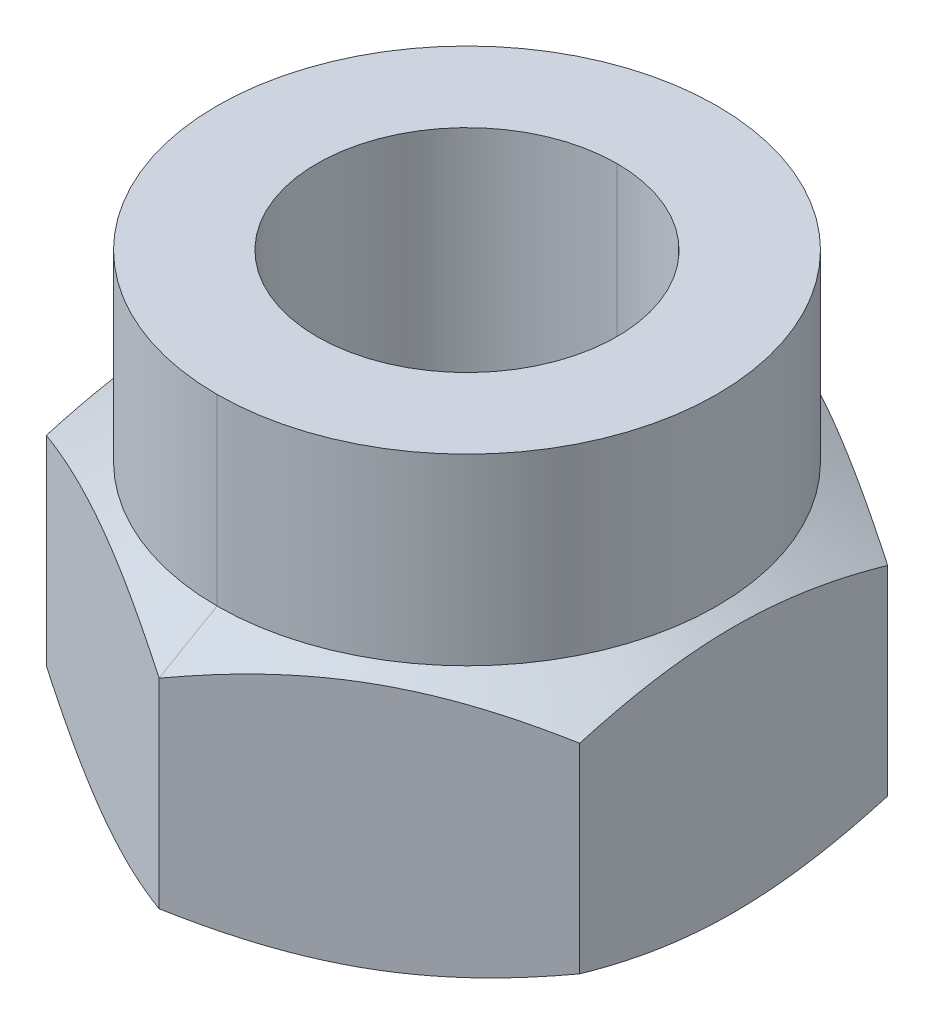
ISO-10303-21;
HEADER;
FILE_DESCRIPTION(('STEP AP214'),'2;1');
FILE_NAME('part.step','',(''),(''),'','','');
FILE_SCHEMA(('AUTOMOTIVE_DESIGN { 1 0 10303 214 1 1 1 1 }'));
ENDSEC;
DATA;
#1=APPLICATION_CONTEXT('core data for automotive mechanical design processes');
#2=APPLICATION_PROTOCOL_DEFINITION('international standard','automotive_design',2000,#1);
#3=PRODUCT_CONTEXT('',#1,'mechanical');
#4=PRODUCT('Part','Part','',(#3));
#5=PRODUCT_RELATED_PRODUCT_CATEGORY('part','',(#4));
#6=PRODUCT_DEFINITION_FORMATION('','',#4);
#7=PRODUCT_DEFINITION_CONTEXT('part definition',#1,'design');
#8=PRODUCT_DEFINITION('design','',#6,#7);
#9=PRODUCT_DEFINITION_SHAPE('','',#8);
#10=(LENGTH_UNIT() NAMED_UNIT(*) SI_UNIT(.MILLI.,.METRE.));
#11=(NAMED_UNIT(*) PLANE_ANGLE_UNIT() SI_UNIT($,.RADIAN.));
#12=(NAMED_UNIT(*) SI_UNIT($,.STERADIAN.) SOLID_ANGLE_UNIT());
#13=UNCERTAINTY_MEASURE_WITH_UNIT(LENGTH_MEASURE(1.E-05),#10,'distance_accuracy_value','');
#14=(GEOMETRIC_REPRESENTATION_CONTEXT(3) GLOBAL_UNCERTAINTY_ASSIGNED_CONTEXT((#13)) GLOBAL_UNIT_ASSIGNED_CONTEXT((#10,
#11,#12)) REPRESENTATION_CONTEXT('',''));
#15=CARTESIAN_POINT('',(0.,0.,0.));
#16=DIRECTION('',(0.,0.,1.));
#17=DIRECTION('',(1.,0.,0.));
#18=AXIS2_PLACEMENT_3D('',#15,#16,#17);
#19=CARTESIAN_POINT('',(86.966,-199.355596428142,0.));
#20=DIRECTION('',(0.,1.,0.));
#21=DIRECTION('',(0.,0.,-1.));
#22=AXIS2_PLACEMENT_3D('',#19,#20,#21);
#23=CONICAL_SURFACE('',#22,14.9987,1.0471975511966);
#24=DIRECTION('',(0.,0.5,0.86602540378444));
#25=VECTOR('',#24,1.);
#26=CARTESIAN_POINT('',(86.966,-199.355596428142,14.9987));
#27=LINE('',#26,#25);
#28=CARTESIAN_POINT('',(86.966,-199.355596428142,14.9987));
#29=VERTEX_POINT('',#28);
#30=CARTESIAN_POINT('',(86.966,-197.347099910636,18.4775180151448));
#31=VERTEX_POINT('',#30);
#32=EDGE_CURVE('E151',#29,#31,#27,.T.);
#33=ORIENTED_EDGE('',*,*,#32,.F.);
#34=CARTESIAN_POINT('',(86.966,-199.355596428142,0.));
#35=DIRECTION('',(0.,1.,0.));
#36=DIRECTION('',(0.,0.,-1.));
#37=AXIS2_PLACEMENT_3D('',#34,#35,#36);
#38=CIRCLE('',#37,14.9987);
#39=CARTESIAN_POINT('',(86.966,-199.355596428142,-14.9987));
#40=VERTEX_POINT('',#39);
#41=EDGE_CURVE('E138',#29,#40,#38,.T.);
#42=ORIENTED_EDGE('',*,*,#41,.T.);
#43=DIRECTION('',(0.,0.5,-0.86602540378444));
#44=VECTOR('',#43,1.);
#45=CARTESIAN_POINT('',(86.966,-199.355596428142,-14.9987));
#46=LINE('',#45,#44);
#47=CARTESIAN_POINT('',(86.966,-197.347099910636,-18.4775180151448));
#48=VERTEX_POINT('',#47);
#49=EDGE_CURVE('E163',#40,#48,#46,.T.);
#50=ORIENTED_EDGE('',*,*,#49,.T.);
#51=CARTESIAN_POINT('',(102.968,-197.347099910636,-9.2387590075724));
#52=CARTESIAN_POINT('',(100.890690690198,-198.039536347237,-10.4380940967768));
#53=CARTESIAN_POINT('',(99.0159936070079,-198.390078069863,-11.5204509624055));
#54=CARTESIAN_POINT('',(96.9583084856887,-198.774835956091,-12.7084560211066));
#55=CARTESIAN_POINT('',(94.9822913717909,-198.776335278788,-13.8493100337388));
#56=CARTESIAN_POINT('',(92.9968654590966,-198.777841740505,-14.995596218889));
#57=CARTESIAN_POINT('',(90.9278801341037,-198.39192205042,-16.190125453223));
#58=CARTESIAN_POINT('',(89.0491954225666,-198.041498384825,-17.2747845771514));
#59=CARTESIAN_POINT('',(86.966,-197.347099910636,-18.4775180151448));
#60=B_SPLINE_CURVE_WITH_KNOTS('',2,(#51,#52,#53,#54,#55,#56,#57,#58,#59),.UNSPECIFIED.,.F.,.F.,
(3,2,2,2,3),(0.,0.25,0.5,0.75,1.),.UNSPECIFIED.);
#61=CARTESIAN_POINT('',(102.968,-197.347099910636,-9.2387590075724));
#62=VERTEX_POINT('',#61);
#63=EDGE_CURVE('E233',#62,#48,#60,.T.);
#64=ORIENTED_EDGE('',*,*,#63,.F.);
#65=CARTESIAN_POINT('',(102.968,-197.347099910636,9.23875900757241));
#66=CARTESIAN_POINT('',(102.968,-198.037173549061,6.84827380214206));
#67=CARTESIAN_POINT('',(102.968,-198.387636491745,4.69043192534636));
#68=CARTESIAN_POINT('',(102.968,-198.776049325974,2.29892806828571));
#69=CARTESIAN_POINT('',(102.968,-198.776340740164,0.00300499255484997));
#70=CARTESIAN_POINT('',(102.968,-198.776630186264,-2.27741237560147));
#71=CARTESIAN_POINT('',(102.968,-198.39364173088,-4.65331801131239));
#72=CARTESIAN_POINT('',(102.968,-198.043170561929,-6.82749954017989));
#73=CARTESIAN_POINT('',(102.968,-197.347099910636,-9.23875900757239));
#74=B_SPLINE_CURVE_WITH_KNOTS('',2,(#65,#66,#67,#68,#69,#70,#71,#72,#73),.UNSPECIFIED.,.F.,.F.,
(3,2,2,2,3),(0.,0.25,0.5,0.75,1.),.UNSPECIFIED.);
#75=CARTESIAN_POINT('',(102.968,-197.347099910636,9.23875900757242));
#76=VERTEX_POINT('',#75);
#77=EDGE_CURVE('E491',#76,#62,#74,.T.);
#78=ORIENTED_EDGE('',*,*,#77,.F.);
#79=CARTESIAN_POINT('',(86.966,-197.347099910636,18.4775180151448));
#80=CARTESIAN_POINT('',(89.0433093086175,-198.039536346842,17.2781829266244));
#81=CARTESIAN_POINT('',(90.9180063929921,-198.390078069863,16.1958260603117));
#82=CARTESIAN_POINT('',(92.9756915139104,-198.774835956207,15.007821001842));
#83=CARTESIAN_POINT('',(94.9517086282091,-198.776335278788,13.8669669889784));
#84=CARTESIAN_POINT('',(96.9371345428436,-198.77784174039,12.7206808027081));
#85=CARTESIAN_POINT('',(99.0061198658963,-198.39192205042,11.5261515694942));
#86=CARTESIAN_POINT('',(100.884804578962,-198.041498384316,10.4414924446834));
#87=CARTESIAN_POINT('',(102.968,-197.347099910636,9.23875900757243));
#88=B_SPLINE_CURVE_WITH_KNOTS('',2,(#79,#80,#81,#82,#83,#84,#85,#86,#87),.UNSPECIFIED.,.F.,.F.,
(3,2,2,2,3),(0.,0.25,0.5,0.75,1.),.UNSPECIFIED.);
#89=EDGE_CURVE('E153',#31,#76,#88,.T.);
#90=ORIENTED_EDGE('',*,*,#89,.F.);
#91=EDGE_LOOP('',(#33,#42,#50,#64,#78,#90));
#92=FACE_BOUND('',#91,.T.);
#93=ADVANCED_FACE('F38',(#92),#23,.T.);
#94=CARTESIAN_POINT('',(86.966,-183.353596428142,0.));
#95=DIRECTION('',(0.,-1.,0.));
#96=DIRECTION('',(0.,0.,1.));
#97=AXIS2_PLACEMENT_3D('',#94,#95,#96);
#98=CONICAL_SURFACE('',#97,14.9987,1.0471975511966);
#99=DIRECTION('',(0.,-0.5,-0.86602540378444));
#100=VECTOR('',#99,1.);
#101=CARTESIAN_POINT('',(86.966,-183.353596428142,-14.9987));
#102=LINE('',#101,#100);
#103=CARTESIAN_POINT('',(86.966,-183.353596428142,-14.9987));
#104=VERTEX_POINT('',#103);
#105=CARTESIAN_POINT('',(86.966,-185.362092945648,-18.4775180151448));
#106=VERTEX_POINT('',#105);
#107=EDGE_CURVE('E183',#104,#106,#102,.T.);
#108=ORIENTED_EDGE('',*,*,#107,.F.);
#109=CARTESIAN_POINT('',(86.966,-183.353596428142,0.));
#110=DIRECTION('',(0.,-1.,0.));
#111=DIRECTION('',(0.,0.,1.));
#112=AXIS2_PLACEMENT_3D('',#109,#110,#111);
#113=CIRCLE('',#112,14.9987);
#114=CARTESIAN_POINT('',(86.966,-183.353596428142,14.9987));
#115=VERTEX_POINT('',#114);
#116=EDGE_CURVE('E178',#104,#115,#113,.T.);
#117=ORIENTED_EDGE('',*,*,#116,.T.);
#118=DIRECTION('',(0.,-0.5,0.86602540378444));
#119=VECTOR('',#118,1.);
#120=CARTESIAN_POINT('',(86.966,-183.353596428142,14.9987));
#121=LINE('',#120,#119);
#122=CARTESIAN_POINT('',(86.966,-185.362092945648,18.4775180151448));
#123=VERTEX_POINT('',#122);
#124=EDGE_CURVE('E193',#115,#123,#121,.T.);
#125=ORIENTED_EDGE('',*,*,#124,.T.);
#126=CARTESIAN_POINT('',(102.968,-185.362092945648,9.23875900757243));
#127=CARTESIAN_POINT('',(100.890690690612,-184.669656509184,10.438094096538));
#128=CARTESIAN_POINT('',(99.0159936070079,-184.319114786421,11.5204509624055));
#129=CARTESIAN_POINT('',(96.9583084844915,-183.934356899902,12.7084560217979));
#130=CARTESIAN_POINT('',(94.9822913717909,-183.932857577496,13.8493100337389));
#131=CARTESIAN_POINT('',(92.9968654566087,-183.931351116068,14.9955962203253));
#132=CARTESIAN_POINT('',(90.9278801341037,-184.317270805864,16.190125453223));
#133=CARTESIAN_POINT('',(89.0491954214829,-184.66769447182,17.2747845777771));
#134=CARTESIAN_POINT('',(86.966,-185.362092945648,18.4775180151448));
#135=B_SPLINE_CURVE_WITH_KNOTS('',2,(#126,#127,#128,#129,#130,#131,#132,#133,#134),
.UNSPECIFIED.,.F.,.F.,(3,2,2,2,3),(0.,0.25,0.5,0.75,1.),.UNSPECIFIED.);
#136=CARTESIAN_POINT('',(102.968,-185.362092945648,9.23875900757242));
#137=VERTEX_POINT('',#136);
#138=EDGE_CURVE('E270',#137,#123,#135,.T.);
#139=ORIENTED_EDGE('',*,*,#138,.F.);
#140=CARTESIAN_POINT('',(102.968,-185.362092945648,-9.23875900757239));
#141=CARTESIAN_POINT('',(102.968,-184.666183307134,-6.82805730480819));
#142=CARTESIAN_POINT('',(102.968,-184.315551343411,-4.65331936360419));
#143=CARTESIAN_POINT('',(102.968,-183.932645227434,-2.27840622250425));
#144=CARTESIAN_POINT('',(102.968,-183.932852118989,0.00303134117684949));
#145=CARTESIAN_POINT('',(102.968,-183.933060235124,2.29797259728489));
#146=CARTESIAN_POINT('',(102.968,-184.321566621199,4.69049508264128));
#147=CARTESIAN_POINT('',(102.968,-184.671871108535,6.8477604268291));
#148=CARTESIAN_POINT('',(102.968,-185.362092945648,9.23875900757241));
#149=B_SPLINE_CURVE_WITH_KNOTS('',2,(#140,#141,#142,#143,#144,#145,#146,#147,#148),
.UNSPECIFIED.,.F.,.F.,(3,2,2,2,3),(0.,0.25,0.5,0.75,1.),.UNSPECIFIED.);
#150=CARTESIAN_POINT('',(102.968,-185.362092945648,-9.2387590075724));
#151=VERTEX_POINT('',#150);
#152=EDGE_CURVE('E475',#151,#137,#149,.T.);
#153=ORIENTED_EDGE('',*,*,#152,.F.);
#154=CARTESIAN_POINT('',(86.966,-185.362092945648,-18.4775180151448));
#155=CARTESIAN_POINT('',(89.0433093097333,-184.669656509069,-17.2781829259802));
#156=CARTESIAN_POINT('',(90.9180063929922,-184.319114786421,-16.1958260603116));
#157=CARTESIAN_POINT('',(92.9756915154957,-183.93435689996,-15.0078210009268));
#158=CARTESIAN_POINT('',(94.9517086282091,-183.932857577496,-13.8669669889784));
#159=CARTESIAN_POINT('',(96.9371345434402,-183.93135111601,-12.7206808023636));
#160=CARTESIAN_POINT('',(99.0061198658963,-184.317270805864,-11.5261515694942));
#161=CARTESIAN_POINT('',(100.884804578934,-184.667694471959,-10.4414924446994));
#162=CARTESIAN_POINT('',(102.968,-185.362092945648,-9.2387590075724));
#163=B_SPLINE_CURVE_WITH_KNOTS('',2,(#154,#155,#156,#157,#158,#159,#160,#161,#162),
.UNSPECIFIED.,.F.,.F.,(3,2,2,2,3),(0.,0.25,0.5,0.75,1.),.UNSPECIFIED.);
#164=EDGE_CURVE('E65',#106,#151,#163,.T.);
#165=ORIENTED_EDGE('',*,*,#164,.F.);
#166=EDGE_LOOP('',(#108,#117,#125,#139,#153,#165));
#167=FACE_BOUND('',#166,.T.);
#168=ADVANCED_FACE('F247',(#167),#98,.T.);
#169=CARTESIAN_POINT('',(86.966,-198.847596428142,0.));
#170=DIRECTION('',(0.,-1.,0.));
#171=DIRECTION('',(0.,0.,-1.));
#172=AXIS2_PLACEMENT_3D('',#169,#170,#171);
#173=CONICAL_SURFACE('',#172,9.,0.785398163397426);
#174=DIRECTION('',(0.,-0.707106781186563,0.707106781186532));
#175=VECTOR('',#174,1.);
#176=CARTESIAN_POINT('',(86.966,-198.847596428142,9.));
#177=LINE('',#176,#175);
#178=CARTESIAN_POINT('',(86.966,-198.847596428142,9.));
#179=VERTEX_POINT('',#178);
#180=CARTESIAN_POINT('',(86.966,-199.355596428142,9.508));
#181=VERTEX_POINT('',#180);
#182=EDGE_CURVE('E192',#179,#181,#177,.T.);
#183=ORIENTED_EDGE('',*,*,#182,.F.);
#184=CARTESIAN_POINT('',(86.966,-198.847596428142,0.));
#185=DIRECTION('',(0.,1.,0.));
#186=DIRECTION('',(0.,0.,-1.));
#187=AXIS2_PLACEMENT_3D('',#184,#185,#186);
#188=CIRCLE('',#187,9.);
#189=CARTESIAN_POINT('',(86.966,-198.847596428142,-9.));
#190=VERTEX_POINT('',#189);
#191=EDGE_CURVE('E11',#179,#190,#188,.T.);
#192=ORIENTED_EDGE('',*,*,#191,.T.);
#193=DIRECTION('',(0.,-0.707106781186563,-0.707106781186532));
#194=VECTOR('',#193,1.);
#195=CARTESIAN_POINT('',(86.966,-198.847596428142,-9.));
#196=LINE('',#195,#194);
#197=CARTESIAN_POINT('',(86.966,-199.355596428142,-9.508));
#198=VERTEX_POINT('',#197);
#199=EDGE_CURVE('E495',#190,#198,#196,.T.);
#200=ORIENTED_EDGE('',*,*,#199,.T.);
#201=CARTESIAN_POINT('',(86.966,-199.355596428142,0.));
#202=DIRECTION('',(0.,-1.,0.));
#203=DIRECTION('',(0.,0.,-1.));
#204=AXIS2_PLACEMENT_3D('',#201,#202,#203);
#205=CIRCLE('',#204,9.508);
#206=EDGE_CURVE('E147',#198,#181,#205,.T.);
#207=ORIENTED_EDGE('',*,*,#206,.T.);
#208=EDGE_LOOP('',(#183,#192,#200,#207));
#209=FACE_BOUND('',#208,.T.);
#210=ADVANCED_FACE('F40',(#209),#173,.F.);
#211=CARTESIAN_POINT('',(86.966,-183.353596428142,0.));
#212=DIRECTION('',(0.,1.,0.));
#213=DIRECTION('',(0.,0.,1.));
#214=AXIS2_PLACEMENT_3D('',#211,#212,#213);
#215=CYLINDRICAL_SURFACE('',#214,9.);
#216=DIRECTION('',(0.,1.,0.));
#217=VECTOR('',#216,1.);
#218=CARTESIAN_POINT('',(86.966,-183.353596428142,-9.));
#219=LINE('',#218,#217);
#220=CARTESIAN_POINT('',(86.966,-172.355396428142,-9.));
#221=VERTEX_POINT('',#220);
#222=EDGE_CURVE('E499',#190,#221,#219,.T.);
#223=ORIENTED_EDGE('',*,*,#222,.F.);
#224=ORIENTED_EDGE('',*,*,#191,.F.);
#225=DIRECTION('',(0.,1.,0.));
#226=VECTOR('',#225,1.);
#227=CARTESIAN_POINT('',(86.966,-183.353596428142,9.));
#228=LINE('',#227,#226);
#229=CARTESIAN_POINT('',(86.966,-172.355396428142,9.));
#230=VERTEX_POINT('',#229);
#231=EDGE_CURVE('E187',#179,#230,#228,.T.);
#232=ORIENTED_EDGE('',*,*,#231,.T.);
#233=CARTESIAN_POINT('',(86.966,-172.355396428142,0.));
#234=DIRECTION('',(0.,1.,0.));
#235=DIRECTION('',(0.,0.,-1.));
#236=AXIS2_PLACEMENT_3D('',#233,#234,#235);
#237=CIRCLE('',#236,9.);
#238=EDGE_CURVE('E51',#230,#221,#237,.T.);
#239=ORIENTED_EDGE('',*,*,#238,.T.);
#240=EDGE_LOOP('',(#223,#224,#232,#239));
#241=FACE_BOUND('',#240,.T.);
#242=ADVANCED_FACE('F287',(#241),#215,.F.);
#243=CARTESIAN_POINT('',(86.966,-183.353596428142,0.));
#244=DIRECTION('',(0.,1.,0.));
#245=DIRECTION('',(0.,0.,1.));
#246=AXIS2_PLACEMENT_3D('',#243,#244,#245);
#247=CYLINDRICAL_SURFACE('',#246,14.9987);
#248=DIRECTION('',(0.,1.,0.));
#249=VECTOR('',#248,1.);
#250=CARTESIAN_POINT('',(86.966,-183.353596428142,-14.9987));
#251=LINE('',#250,#249);
#252=CARTESIAN_POINT('',(86.966,-172.355396428142,-14.9987));
#253=VERTEX_POINT('',#252);
#254=EDGE_CURVE('E173',#104,#253,#251,.T.);
#255=ORIENTED_EDGE('',*,*,#254,.F.);
#256=CARTESIAN_POINT('',(86.966,-183.353596428142,0.));
#257=DIRECTION('',(0.,-1.,0.));
#258=DIRECTION('',(0.,0.,1.));
#259=AXIS2_PLACEMENT_3D('',#256,#257,#258);
#260=CIRCLE('',#259,14.9987);
#261=EDGE_CURVE('E179',#115,#104,#260,.T.);
#262=ORIENTED_EDGE('',*,*,#261,.F.);
#263=DIRECTION('',(0.,1.,0.));
#264=VECTOR('',#263,1.);
#265=CARTESIAN_POINT('',(86.966,-183.353596428142,14.9987));
#266=LINE('',#265,#264);
#267=CARTESIAN_POINT('',(86.966,-172.355396428142,14.9987));
#268=VERTEX_POINT('',#267);
#269=EDGE_CURVE('E462',#115,#268,#266,.T.);
#270=ORIENTED_EDGE('',*,*,#269,.T.);
#271=CARTESIAN_POINT('',(86.966,-172.355396428142,0.));
#272=DIRECTION('',(0.,1.,0.));
#273=DIRECTION('',(0.,0.,-1.));
#274=AXIS2_PLACEMENT_3D('',#271,#272,#273);
#275=CIRCLE('',#274,14.9987);
#276=EDGE_CURVE('E194',#253,#268,#275,.T.);
#277=ORIENTED_EDGE('',*,*,#276,.F.);
#278=EDGE_LOOP('',(#255,#262,#270,#277));
#279=FACE_BOUND('',#278,.T.);
#280=ADVANCED_FACE('F381',(#279),#247,.T.);
#281=CARTESIAN_POINT('',(86.966,-172.355396428142,0.));
#282=DIRECTION('',(0.,-1.,0.));
#283=DIRECTION('',(0.,0.,-1.));
#284=AXIS2_PLACEMENT_3D('',#281,#282,#283);
#285=PLANE('',#284);
#286=ORIENTED_EDGE('',*,*,#238,.F.);
#287=CARTESIAN_POINT('',(86.966,-172.355396428142,0.));
#288=DIRECTION('',(0.,1.,0.));
#289=DIRECTION('',(0.,0.,-1.));
#290=AXIS2_PLACEMENT_3D('',#287,#288,#289);
#291=CIRCLE('',#290,9.);
#292=EDGE_CURVE('E523',#221,#230,#291,.T.);
#293=ORIENTED_EDGE('',*,*,#292,.F.);
#294=EDGE_LOOP('',(#286,#293));
#295=FACE_BOUND('',#294,.T.);
#296=CARTESIAN_POINT('',(86.966,-172.355396428142,0.));
#297=DIRECTION('',(0.,1.,0.));
#298=DIRECTION('',(0.,0.,-1.));
#299=AXIS2_PLACEMENT_3D('',#296,#297,#298);
#300=CIRCLE('',#299,14.9987);
#301=EDGE_CURVE('E177',#268,#253,#300,.T.);
#302=ORIENTED_EDGE('',*,*,#301,.T.);
#303=ORIENTED_EDGE('',*,*,#276,.T.);
#304=EDGE_LOOP('',(#302,#303));
#305=FACE_BOUND('',#304,.T.);
#306=ADVANCED_FACE('F248',(#295,#305),#285,.F.);
#307=CARTESIAN_POINT('',(0.,-199.355596428142,0.));
#308=DIRECTION('',(0.,-1.,0.));
#309=DIRECTION('',(0.,0.,-1.));
#310=AXIS2_PLACEMENT_3D('',#307,#308,#309);
#311=PLANE('',#310);
#312=ORIENTED_EDGE('',*,*,#206,.F.);
#313=CARTESIAN_POINT('',(86.966,-199.355596428142,0.));
#314=DIRECTION('',(0.,-1.,0.));
#315=DIRECTION('',(0.,0.,-1.));
#316=AXIS2_PLACEMENT_3D('',#313,#314,#315);
#317=CIRCLE('',#316,9.508);
#318=EDGE_CURVE('E500',#181,#198,#317,.T.);
#319=ORIENTED_EDGE('',*,*,#318,.F.);
#320=EDGE_LOOP('',(#312,#319));
#321=FACE_BOUND('',#320,.T.);
#322=CARTESIAN_POINT('',(86.966,-199.355596428142,0.));
#323=DIRECTION('',(0.,1.,0.));
#324=DIRECTION('',(0.,0.,-1.));
#325=AXIS2_PLACEMENT_3D('',#322,#323,#324);
#326=CIRCLE('',#325,14.9987);
#327=EDGE_CURVE('E142',#40,#29,#326,.T.);
#328=ORIENTED_EDGE('',*,*,#327,.F.);
#329=ORIENTED_EDGE('',*,*,#41,.F.);
#330=EDGE_LOOP('',(#328,#329));
#331=FACE_BOUND('',#330,.T.);
#332=ADVANCED_FACE('F140',(#321,#331),#311,.T.);
#333=CARTESIAN_POINT('',(70.964,-199.355596428142,-9.2387590075724));
#334=DIRECTION('',(1.,0.,0.));
#335=DIRECTION('',(0.,1.,0.));
#336=AXIS2_PLACEMENT_3D('',#333,#334,#335);
#337=PLANE('',#336);
#338=CARTESIAN_POINT('',(70.964,-197.347099910636,-9.2387590075724));
#339=CARTESIAN_POINT('',(70.964,-198.043009712467,-6.82805673906218));
#340=CARTESIAN_POINT('',(70.964,-198.39364173088,-4.65331801131238));
#341=CARTESIAN_POINT('',(70.964,-198.776545439066,-2.27841931563796));
#342=CARTESIAN_POINT('',(70.964,-198.776340740164,0.0030049925548413));
#343=CARTESIAN_POINT('',(70.964,-198.776134830001,2.29792911326344));
#344=CARTESIAN_POINT('',(70.964,-198.387636491744,4.69043192534634));
#345=CARTESIAN_POINT('',(70.964,-198.037331752691,6.8477257686927));
#346=CARTESIAN_POINT('',(70.964,-197.347099910636,9.2387590075724));
#347=B_SPLINE_CURVE_WITH_KNOTS('',2,(#338,#339,#340,#341,#342,#343,#344,#345,#346),
.UNSPECIFIED.,.F.,.F.,(3,2,2,2,3),(0.,0.25,0.5,0.75,1.),.UNSPECIFIED.);
#348=CARTESIAN_POINT('',(70.964,-197.347099910636,-9.2387590075724));
#349=VERTEX_POINT('',#348);
#350=CARTESIAN_POINT('',(70.964,-197.347099910636,9.23875900757239));
#351=VERTEX_POINT('',#350);
#352=EDGE_CURVE('E409',#349,#351,#347,.T.);
#353=ORIENTED_EDGE('',*,*,#352,.T.);
#354=DIRECTION('',(0.,1.,0.));
#355=VECTOR('',#354,1.);
#356=CARTESIAN_POINT('',(70.964,-199.355596428142,9.2387590075724));
#357=LINE('',#356,#355);
#358=CARTESIAN_POINT('',(70.964,-185.362092945648,9.2387590075724));
#359=VERTEX_POINT('',#358);
#360=EDGE_CURVE('E330',#351,#359,#357,.T.);
#361=ORIENTED_EDGE('',*,*,#360,.T.);
#362=CARTESIAN_POINT('',(70.964,-185.362092945648,9.2387590075724));
#363=CARTESIAN_POINT('',(70.964,-184.672029193753,6.8483080500872));
#364=CARTESIAN_POINT('',(70.964,-184.321566621199,4.69049508264124));
#365=CARTESIAN_POINT('',(70.964,-183.933145696158,2.29897092424086));
#366=CARTESIAN_POINT('',(70.964,-183.93285211899,0.00303134117683214));
#367=CARTESIAN_POINT('',(70.964,-183.932560524848,-2.27739984892269));
#368=CARTESIAN_POINT('',(70.964,-184.315551343411,-4.65331936360422));
#369=CARTESIAN_POINT('',(70.964,-184.666022555367,-6.8275004443534));
#370=CARTESIAN_POINT('',(70.964,-185.362092945648,-9.2387590075724));
#371=B_SPLINE_CURVE_WITH_KNOTS('',2,(#362,#363,#364,#365,#366,#367,#368,#369,#370),
.UNSPECIFIED.,.F.,.F.,(3,2,2,2,3),(0.,0.25,0.5,0.75,1.),.UNSPECIFIED.);
#372=CARTESIAN_POINT('',(70.964,-185.362092945648,-9.2387590075724));
#373=VERTEX_POINT('',#372);
#374=EDGE_CURVE('E454',#359,#373,#371,.T.);
#375=ORIENTED_EDGE('',*,*,#374,.T.);
#376=DIRECTION('',(0.,1.,0.));
#377=VECTOR('',#376,1.);
#378=CARTESIAN_POINT('',(70.964,-199.355596428142,-9.2387590075724));
#379=LINE('',#378,#377);
#380=EDGE_CURVE('E148',#349,#373,#379,.T.);
#381=ORIENTED_EDGE('',*,*,#380,.F.);
#382=EDGE_LOOP('',(#353,#361,#375,#381));
#383=FACE_BOUND('',#382,.T.);
#384=ADVANCED_FACE('F249',(#383),#337,.F.);
#385=CARTESIAN_POINT('',(86.966,-199.355596428142,-18.4775180151448));
#386=DIRECTION('',(0.5,0.,0.866025403784439));
#387=DIRECTION('',(0.,-1.,0.));
#388=AXIS2_PLACEMENT_3D('',#385,#386,#387);
#389=PLANE('',#388);
#390=CARTESIAN_POINT('',(86.966,-197.347099910636,-18.4775180151448));
#391=CARTESIAN_POINT('',(84.8886906898474,-198.039536347354,-17.2781829257381));
#392=CARTESIAN_POINT('',(83.0139936070078,-198.390078069862,-16.1958260603117));
#393=CARTESIAN_POINT('',(80.9563084841423,-198.774835956324,-15.0078210007177));
#394=CARTESIAN_POINT('',(78.9802913717909,-198.776335278788,-13.8669669889784));
#395=CARTESIAN_POINT('',(76.9948654562615,-198.777841740274,-12.7206808021914));
#396=CARTESIAN_POINT('',(74.9258801341037,-198.39192205042,-11.5261515694942));
#397=CARTESIAN_POINT('',(73.0471954207207,-198.04149838421,-10.4414924445001));
#398=CARTESIAN_POINT('',(70.964,-197.347099910636,-9.2387590075724));
#399=B_SPLINE_CURVE_WITH_KNOTS('',2,(#390,#391,#392,#393,#394,#395,#396,#397,#398),
.UNSPECIFIED.,.F.,.F.,(3,2,2,2,3),(0.,0.25,0.5,0.75,1.),.UNSPECIFIED.);
#400=EDGE_CURVE('E396',#48,#349,#399,.T.);
#401=ORIENTED_EDGE('',*,*,#400,.T.);
#402=ORIENTED_EDGE('',*,*,#380,.T.);
#403=CARTESIAN_POINT('',(70.964,-185.362092945648,-9.2387590075724));
#404=CARTESIAN_POINT('',(73.0413093101883,-184.669656508918,-10.4380940969997));
#405=CARTESIAN_POINT('',(74.9160063929921,-184.319114786421,-11.5204509624056));
#406=CARTESIAN_POINT('',(76.973691515887,-183.93435689996,-12.7084560220164));
#407=CARTESIAN_POINT('',(78.9497086282091,-183.932857577496,-13.8493100337388));
#408=CARTESIAN_POINT('',(80.9351345434341,-183.93135111601,-14.99559622035));
#409=CARTESIAN_POINT('',(83.0041198658963,-184.317270805864,-16.190125453223));
#410=CARTESIAN_POINT('',(84.8828045789264,-184.667694471956,-17.2747845780134));
#411=CARTESIAN_POINT('',(86.966,-185.362092945648,-18.4775180151448));
#412=B_SPLINE_CURVE_WITH_KNOTS('',2,(#403,#404,#405,#406,#407,#408,#409,#410,#411),
.UNSPECIFIED.,.F.,.F.,(3,2,2,2,3),(0.,0.25,0.5,0.75,1.),.UNSPECIFIED.);
#413=EDGE_CURVE('E366',#373,#106,#412,.T.);
#414=ORIENTED_EDGE('',*,*,#413,.T.);
#415=DIRECTION('',(0.,1.,0.));
#416=VECTOR('',#415,1.);
#417=CARTESIAN_POINT('',(86.966,-199.355596428142,-18.4775180151448));
#418=LINE('',#417,#416);
#419=EDGE_CURVE('E538',#48,#106,#418,.T.);
#420=ORIENTED_EDGE('',*,*,#419,.F.);
#421=EDGE_LOOP('',(#401,#402,#414,#420));
#422=FACE_BOUND('',#421,.T.);
#423=ADVANCED_FACE('F213',(#422),#389,.F.);
#424=CARTESIAN_POINT('',(102.968,-199.355596428142,-9.2387590075724));
#425=DIRECTION('',(-0.5,0.,0.866025403784439));
#426=DIRECTION('',(0.,1.,0.));
#427=AXIS2_PLACEMENT_3D('',#424,#425,#426);
#428=PLANE('',#427);
#429=ORIENTED_EDGE('',*,*,#63,.T.);
#430=ORIENTED_EDGE('',*,*,#419,.T.);
#431=ORIENTED_EDGE('',*,*,#164,.T.);
#432=DIRECTION('',(0.,1.,0.));
#433=VECTOR('',#432,1.);
#434=CARTESIAN_POINT('',(102.968,-199.355596428142,-9.2387590075724));
#435=LINE('',#434,#433);
#436=EDGE_CURVE('E479',#62,#151,#435,.T.);
#437=ORIENTED_EDGE('',*,*,#436,.F.);
#438=EDGE_LOOP('',(#429,#430,#431,#437));
#439=FACE_BOUND('',#438,.T.);
#440=ADVANCED_FACE('F203',(#439),#428,.F.);
#441=CARTESIAN_POINT('',(102.968,-199.355596428142,9.23875900757241));
#442=DIRECTION('',(-1.,0.,0.));
#443=DIRECTION('',(0.,0.,1.));
#444=AXIS2_PLACEMENT_3D('',#441,#442,#443);
#445=PLANE('',#444);
#446=ORIENTED_EDGE('',*,*,#77,.T.);
#447=ORIENTED_EDGE('',*,*,#436,.T.);
#448=ORIENTED_EDGE('',*,*,#152,.T.);
#449=DIRECTION('',(0.,1.,0.));
#450=VECTOR('',#449,1.);
#451=CARTESIAN_POINT('',(102.968,-199.355596428142,9.23875900757241));
#452=LINE('',#451,#450);
#453=EDGE_CURVE('E516',#76,#137,#452,.T.);
#454=ORIENTED_EDGE('',*,*,#453,.F.);
#455=EDGE_LOOP('',(#446,#447,#448,#454));
#456=FACE_BOUND('',#455,.T.);
#457=ADVANCED_FACE('F212',(#456),#445,.F.);
#458=CARTESIAN_POINT('',(86.966,-199.355596428142,18.4775180151448));
#459=DIRECTION('',(-0.5,0.,-0.866025403784439));
#460=DIRECTION('',(-0.866025403784439,0.,0.5));
#461=AXIS2_PLACEMENT_3D('',#458,#459,#460);
#462=PLANE('',#461);
#463=ORIENTED_EDGE('',*,*,#89,.T.);
#464=ORIENTED_EDGE('',*,*,#453,.T.);
#465=ORIENTED_EDGE('',*,*,#138,.T.);
#466=DIRECTION('',(0.,1.,0.));
#467=VECTOR('',#466,1.);
#468=CARTESIAN_POINT('',(86.966,-199.355596428142,18.4775180151448));
#469=LINE('',#468,#467);
#470=EDGE_CURVE('E466',#31,#123,#469,.T.);
#471=ORIENTED_EDGE('',*,*,#470,.F.);
#472=EDGE_LOOP('',(#463,#464,#465,#471));
#473=FACE_BOUND('',#472,.T.);
#474=ADVANCED_FACE('F277',(#473),#462,.F.);
#475=CARTESIAN_POINT('',(70.964,-199.355596428142,9.2387590075724));
#476=DIRECTION('',(0.5,0.,-0.866025403784439));
#477=DIRECTION('',(0.,-1.,0.));
#478=AXIS2_PLACEMENT_3D('',#475,#476,#477);
#479=PLANE('',#478);
#480=CARTESIAN_POINT('',(70.964,-197.347099910636,9.2387590075724));
#481=CARTESIAN_POINT('',(73.0413093094176,-198.039536347109,10.4380940965547));
#482=CARTESIAN_POINT('',(74.9160063929922,-198.390078069863,11.5204509624055));
#483=CARTESIAN_POINT('',(76.9736915149127,-198.774835956265,12.7084560214538));
#484=CARTESIAN_POINT('',(78.9497086282091,-198.776335278788,13.8493100337388));
#485=CARTESIAN_POINT('',(80.9351345424949,-198.777841740332,14.9955962198078));
#486=CARTESIAN_POINT('',(83.0041198658963,-198.39192205042,16.190125453223));
#487=CARTESIAN_POINT('',(84.8828045781983,-198.04149838457,17.274784577593));
#488=CARTESIAN_POINT('',(86.966,-197.347099910636,18.4775180151448));
#489=B_SPLINE_CURVE_WITH_KNOTS('',2,(#480,#481,#482,#483,#484,#485,#486,#487,#488),
.UNSPECIFIED.,.F.,.F.,(3,2,2,2,3),(0.,0.25,0.5,0.75,1.),.UNSPECIFIED.);
#490=EDGE_CURVE('E159',#351,#31,#489,.T.);
#491=ORIENTED_EDGE('',*,*,#490,.T.);
#492=ORIENTED_EDGE('',*,*,#470,.T.);
#493=CARTESIAN_POINT('',(86.966,-185.362092945648,18.4775180151448));
#494=CARTESIAN_POINT('',(84.8886906906157,-184.669656509186,17.2781829261816));
#495=CARTESIAN_POINT('',(83.0139936070079,-184.319114786421,16.1958260603117));
#496=CARTESIAN_POINT('',(80.9563084848053,-183.93435689996,15.0078210011005));
#497=CARTESIAN_POINT('',(78.9802913717909,-183.932857577496,13.8669669889784));
#498=CARTESIAN_POINT('',(76.9948654571929,-183.93135111601,12.7206808027292));
#499=CARTESIAN_POINT('',(74.9258801341037,-184.317270805864,11.5261515694942));
#500=CARTESIAN_POINT('',(73.0471954217993,-184.667694471714,10.4414924451228));
#501=CARTESIAN_POINT('',(70.964,-185.362092945648,9.2387590075724));
#502=B_SPLINE_CURVE_WITH_KNOTS('',2,(#493,#494,#495,#496,#497,#498,#499,#500,#501),
.UNSPECIFIED.,.F.,.F.,(3,2,2,2,3),(0.,0.25,0.5,0.75,1.),.UNSPECIFIED.);
#503=EDGE_CURVE('E314',#123,#359,#502,.T.);
#504=ORIENTED_EDGE('',*,*,#503,.T.);
#505=ORIENTED_EDGE('',*,*,#360,.F.);
#506=EDGE_LOOP('',(#491,#492,#504,#505));
#507=FACE_BOUND('',#506,.T.);
#508=ADVANCED_FACE('F216',(#507),#479,.F.);
#509=CARTESIAN_POINT('',(86.966,-183.353596428142,0.));
#510=DIRECTION('',(0.,1.,0.));
#511=DIRECTION('',(0.,0.,1.));
#512=AXIS2_PLACEMENT_3D('',#509,#510,#511);
#513=CYLINDRICAL_SURFACE('',#512,14.9987);
#514=ORIENTED_EDGE('',*,*,#116,.F.);
#515=ORIENTED_EDGE('',*,*,#254,.T.);
#516=ORIENTED_EDGE('',*,*,#301,.F.);
#517=ORIENTED_EDGE('',*,*,#269,.F.);
#518=EDGE_LOOP('',(#514,#515,#516,#517));
#519=FACE_BOUND('',#518,.T.);
#520=ADVANCED_FACE('F286',(#519),#513,.T.);
#521=CARTESIAN_POINT('',(86.966,-183.353596428142,0.));
#522=DIRECTION('',(0.,1.,0.));
#523=DIRECTION('',(0.,0.,1.));
#524=AXIS2_PLACEMENT_3D('',#521,#522,#523);
#525=CYLINDRICAL_SURFACE('',#524,9.);
#526=CARTESIAN_POINT('',(86.966,-198.847596428142,0.));
#527=DIRECTION('',(0.,1.,0.));
#528=DIRECTION('',(0.,0.,-1.));
#529=AXIS2_PLACEMENT_3D('',#526,#527,#528);
#530=CIRCLE('',#529,9.);
#531=EDGE_CURVE('E188',#190,#179,#530,.T.);
#532=ORIENTED_EDGE('',*,*,#531,.F.);
#533=ORIENTED_EDGE('',*,*,#222,.T.);
#534=ORIENTED_EDGE('',*,*,#292,.T.);
#535=ORIENTED_EDGE('',*,*,#231,.F.);
#536=EDGE_LOOP('',(#532,#533,#534,#535));
#537=FACE_BOUND('',#536,.T.);
#538=ADVANCED_FACE('F573',(#537),#525,.F.);
#539=CARTESIAN_POINT('',(86.966,-198.847596428142,0.));
#540=DIRECTION('',(0.,-1.,0.));
#541=DIRECTION('',(0.,0.,-1.));
#542=AXIS2_PLACEMENT_3D('',#539,#540,#541);
#543=CONICAL_SURFACE('',#542,9.,0.785398163397426);
#544=ORIENTED_EDGE('',*,*,#531,.T.);
#545=ORIENTED_EDGE('',*,*,#182,.T.);
#546=ORIENTED_EDGE('',*,*,#318,.T.);
#547=ORIENTED_EDGE('',*,*,#199,.F.);
#548=EDGE_LOOP('',(#544,#545,#546,#547));
#549=FACE_BOUND('',#548,.T.);
#550=ADVANCED_FACE('F341',(#549),#543,.F.);
#551=CARTESIAN_POINT('',(86.966,-183.353596428142,0.));
#552=DIRECTION('',(0.,-1.,0.));
#553=DIRECTION('',(0.,0.,1.));
#554=AXIS2_PLACEMENT_3D('',#551,#552,#553);
#555=CONICAL_SURFACE('',#554,14.9987,1.0471975511966);
#556=ORIENTED_EDGE('',*,*,#261,.T.);
#557=ORIENTED_EDGE('',*,*,#107,.T.);
#558=ORIENTED_EDGE('',*,*,#413,.F.);
#559=ORIENTED_EDGE('',*,*,#374,.F.);
#560=ORIENTED_EDGE('',*,*,#503,.F.);
#561=ORIENTED_EDGE('',*,*,#124,.F.);
#562=EDGE_LOOP('',(#556,#557,#558,#559,#560,#561));
#563=FACE_BOUND('',#562,.T.);
#564=ADVANCED_FACE('F332',(#563),#555,.T.);
#565=CARTESIAN_POINT('',(86.966,-199.355596428142,0.));
#566=DIRECTION('',(0.,1.,0.));
#567=DIRECTION('',(0.,0.,-1.));
#568=AXIS2_PLACEMENT_3D('',#565,#566,#567);
#569=CONICAL_SURFACE('',#568,14.9987,1.0471975511966);
#570=ORIENTED_EDGE('',*,*,#327,.T.);
#571=ORIENTED_EDGE('',*,*,#32,.T.);
#572=ORIENTED_EDGE('',*,*,#490,.F.);
#573=ORIENTED_EDGE('',*,*,#352,.F.);
#574=ORIENTED_EDGE('',*,*,#400,.F.);
#575=ORIENTED_EDGE('',*,*,#49,.F.);
#576=EDGE_LOOP('',(#570,#571,#572,#573,#574,#575));
#577=FACE_BOUND('',#576,.T.);
#578=ADVANCED_FACE('F161',(#577),#569,.T.);
#579=CLOSED_SHELL('',(#93,#168,#210,#242,#280,#306,#332,#384,#423,#440,#457,#474,#508,#520,#538,
#550,#564,#578));
#580=MANIFOLD_SOLID_BREP('B2',#579);
#581=ADVANCED_BREP_SHAPE_REPRESENTATION('',(#18,#580),#14);
#582=SHAPE_DEFINITION_REPRESENTATION(#9,#581);
ENDSEC;
END-ISO-10303-21;
